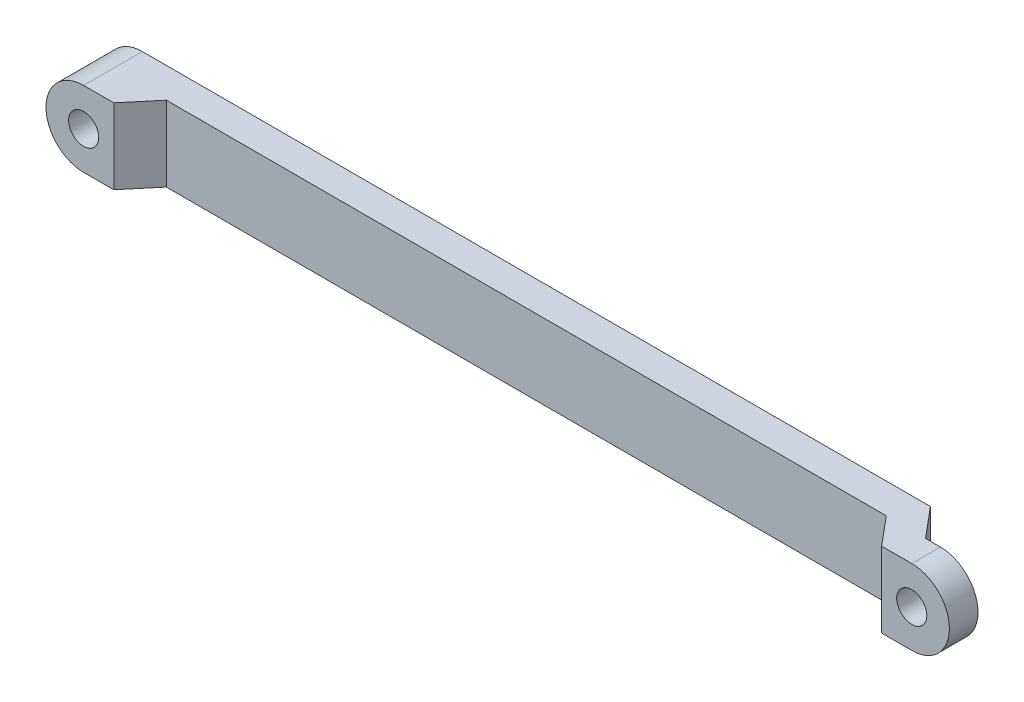
ISO-10303-21;
HEADER;
FILE_DESCRIPTION(('STEP AP214'),'2;1');
FILE_NAME('part.step','',(''),(''),'','','');
FILE_SCHEMA(('AUTOMOTIVE_DESIGN { 1 0 10303 214 1 1 1 1 }'));
ENDSEC;
DATA;
#1=APPLICATION_CONTEXT('core data for automotive mechanical design processes');
#2=APPLICATION_PROTOCOL_DEFINITION('international standard','automotive_design',2000,#1);
#3=PRODUCT_CONTEXT('',#1,'mechanical');
#4=PRODUCT('Part','Part','',(#3));
#5=PRODUCT_RELATED_PRODUCT_CATEGORY('part','',(#4));
#6=PRODUCT_DEFINITION_FORMATION('','',#4);
#7=PRODUCT_DEFINITION_CONTEXT('part definition',#1,'design');
#8=PRODUCT_DEFINITION('design','',#6,#7);
#9=PRODUCT_DEFINITION_SHAPE('','',#8);
#10=(LENGTH_UNIT() NAMED_UNIT(*) SI_UNIT(.MILLI.,.METRE.));
#11=(NAMED_UNIT(*) PLANE_ANGLE_UNIT() SI_UNIT($,.RADIAN.));
#12=(NAMED_UNIT(*) SI_UNIT($,.STERADIAN.) SOLID_ANGLE_UNIT());
#13=UNCERTAINTY_MEASURE_WITH_UNIT(LENGTH_MEASURE(1.E-05),#10,'distance_accuracy_value','');
#14=(GEOMETRIC_REPRESENTATION_CONTEXT(3) GLOBAL_UNCERTAINTY_ASSIGNED_CONTEXT((#13)) GLOBAL_UNIT_ASSIGNED_CONTEXT((#10,
#11,#12)) REPRESENTATION_CONTEXT('',''));
#15=CARTESIAN_POINT('',(0.,0.,0.));
#16=DIRECTION('',(0.,0.,1.));
#17=DIRECTION('',(1.,0.,0.));
#18=AXIS2_PLACEMENT_3D('',#15,#16,#17);
#19=CARTESIAN_POINT('',(-275.,0.,29.));
#20=DIRECTION('',(0.,0.,1.));
#21=DIRECTION('',(1.,0.,0.));
#22=AXIS2_PLACEMENT_3D('',#19,#20,#21);
#23=PLANE('',#22);
#24=DIRECTION('',(0.,-1.,0.));
#25=VECTOR('',#24,1.);
#26=CARTESIAN_POINT('',(255.,25.,29.0000000000017));
#27=LINE('',#26,#25);
#28=CARTESIAN_POINT('',(255.,25.,29.0000000000017));
#29=VERTEX_POINT('',#28);
#30=CARTESIAN_POINT('',(255.,-25.,29.0000000000017));
#31=VERTEX_POINT('',#30);
#32=EDGE_CURVE('E331',#29,#31,#27,.T.);
#33=ORIENTED_EDGE('',*,*,#32,.T.);
#34=DIRECTION('',(1.,0.,0.));
#35=VECTOR('',#34,1.);
#36=CARTESIAN_POINT('',(-275.,-25.,29.));
#37=LINE('',#36,#35);
#38=CARTESIAN_POINT('',(275.,-25.,29.));
#39=VERTEX_POINT('',#38);
#40=EDGE_CURVE('E130',#31,#39,#37,.T.);
#41=ORIENTED_EDGE('',*,*,#40,.T.);
#42=CARTESIAN_POINT('',(275.,0.,29.));
#43=DIRECTION('',(0.,0.,1.));
#44=DIRECTION('',(1.,0.,0.));
#45=AXIS2_PLACEMENT_3D('',#42,#43,#44);
#46=CIRCLE('',#45,25.);
#47=CARTESIAN_POINT('',(275.,25.,29.));
#48=VERTEX_POINT('',#47);
#49=EDGE_CURVE('E170',#39,#48,#46,.T.);
#50=ORIENTED_EDGE('',*,*,#49,.T.);
#51=DIRECTION('',(-1.,0.,0.));
#52=VECTOR('',#51,1.);
#53=CARTESIAN_POINT('',(-275.,25.,29.));
#54=LINE('',#53,#52);
#55=EDGE_CURVE('E138',#48,#29,#54,.T.);
#56=ORIENTED_EDGE('',*,*,#55,.T.);
#57=EDGE_LOOP('',(#33,#41,#50,#56));
#58=FACE_BOUND('',#57,.T.);
#59=CARTESIAN_POINT('',(275.,0.,29.));
#60=DIRECTION('',(0.,0.,1.));
#61=DIRECTION('',(1.,0.,0.));
#62=AXIS2_PLACEMENT_3D('',#59,#60,#61);
#63=CIRCLE('',#62,9.99999999999998);
#64=CARTESIAN_POINT('',(285.,0.,29.));
#65=VERTEX_POINT('',#64);
#66=EDGE_CURVE('E158',#65,#65,#63,.T.);
#67=ORIENTED_EDGE('',*,*,#66,.F.);
#68=EDGE_LOOP('',(#67));
#69=FACE_BOUND('',#68,.T.);
#70=ADVANCED_FACE('F16',(#58,#69),#23,.T.);
#71=DIRECTION('',(0.,-1.,0.));
#72=VECTOR('',#71,1.);
#73=CARTESIAN_POINT('',(-255.,25.,29.));
#74=LINE('',#73,#72);
#75=CARTESIAN_POINT('',(-255.,25.,29.));
#76=VERTEX_POINT('',#75);
#77=CARTESIAN_POINT('',(-255.,-25.,29.));
#78=VERTEX_POINT('',#77);
#79=EDGE_CURVE('E184',#76,#78,#74,.T.);
#80=ORIENTED_EDGE('',*,*,#79,.F.);
#81=CARTESIAN_POINT('',(-275.,25.,29.));
#82=VERTEX_POINT('',#81);
#83=EDGE_CURVE('E172',#76,#82,#54,.T.);
#84=ORIENTED_EDGE('',*,*,#83,.T.);
#85=CARTESIAN_POINT('',(-275.,0.,29.));
#86=DIRECTION('',(0.,0.,1.));
#87=DIRECTION('',(1.,0.,0.));
#88=AXIS2_PLACEMENT_3D('',#85,#86,#87);
#89=CIRCLE('',#88,25.);
#90=CARTESIAN_POINT('',(-275.,-25.,29.));
#91=VERTEX_POINT('',#90);
#92=EDGE_CURVE('E126',#82,#91,#89,.T.);
#93=ORIENTED_EDGE('',*,*,#92,.T.);
#94=EDGE_CURVE('E167',#91,#78,#37,.T.);
#95=ORIENTED_EDGE('',*,*,#94,.T.);
#96=EDGE_LOOP('',(#80,#84,#93,#95));
#97=FACE_BOUND('',#96,.T.);
#98=CARTESIAN_POINT('',(-275.,0.,29.));
#99=DIRECTION('',(0.,0.,1.));
#100=DIRECTION('',(1.,0.,0.));
#101=AXIS2_PLACEMENT_3D('',#98,#99,#100);
#102=CIRCLE('',#101,9.99999999999998);
#103=CARTESIAN_POINT('',(-265.,0.,29.));
#104=VERTEX_POINT('',#103);
#105=EDGE_CURVE('E160',#104,#104,#102,.T.);
#106=ORIENTED_EDGE('',*,*,#105,.F.);
#107=EDGE_LOOP('',(#106));
#108=FACE_BOUND('',#107,.T.);
#109=ADVANCED_FACE('F180',(#97,#108),#23,.T.);
#110=CARTESIAN_POINT('',(-275.,0.,-10.));
#111=DIRECTION('',(0.,0.,1.));
#112=DIRECTION('',(1.,0.,0.));
#113=AXIS2_PLACEMENT_3D('',#110,#111,#112);
#114=PLANE('',#113);
#115=DIRECTION('',(-1.,0.,0.));
#116=VECTOR('',#115,1.);
#117=CARTESIAN_POINT('',(-275.,25.,-10.));
#118=LINE('',#117,#116);
#119=CARTESIAN_POINT('',(248.38326017071,25.,-10.0000000000259));
#120=VERTEX_POINT('',#119);
#121=CARTESIAN_POINT('',(-275.,25.,-10.));
#122=VERTEX_POINT('',#121);
#123=EDGE_CURVE('E114',#120,#122,#118,.T.);
#124=ORIENTED_EDGE('',*,*,#123,.F.);
#125=DIRECTION('',(0.,-1.,0.));
#126=VECTOR('',#125,1.);
#127=CARTESIAN_POINT('',(248.38326017071,25.,-10.0000000000259));
#128=LINE('',#127,#126);
#129=CARTESIAN_POINT('',(248.38326017071,-25.,-10.0000000000259));
#130=VERTEX_POINT('',#129);
#131=EDGE_CURVE('E99',#120,#130,#128,.T.);
#132=ORIENTED_EDGE('',*,*,#131,.T.);
#133=DIRECTION('',(1.,0.,0.));
#134=VECTOR('',#133,1.);
#135=CARTESIAN_POINT('',(-275.,-25.,-10.));
#136=LINE('',#135,#134);
#137=CARTESIAN_POINT('',(-275.,-25.,-10.));
#138=VERTEX_POINT('',#137);
#139=EDGE_CURVE('E127',#138,#130,#136,.T.);
#140=ORIENTED_EDGE('',*,*,#139,.F.);
#141=CARTESIAN_POINT('',(-275.,0.,-10.));
#142=DIRECTION('',(0.,0.,1.));
#143=DIRECTION('',(1.,0.,0.));
#144=AXIS2_PLACEMENT_3D('',#141,#142,#143);
#145=CIRCLE('',#144,25.);
#146=EDGE_CURVE('E125',#122,#138,#145,.T.);
#147=ORIENTED_EDGE('',*,*,#146,.F.);
#148=EDGE_LOOP('',(#124,#132,#140,#147));
#149=FACE_BOUND('',#148,.T.);
#150=CARTESIAN_POINT('',(-275.,0.,-10.));
#151=DIRECTION('',(0.,0.,1.));
#152=DIRECTION('',(1.,0.,0.));
#153=AXIS2_PLACEMENT_3D('',#150,#151,#152);
#154=CIRCLE('',#153,9.99999999999998);
#155=CARTESIAN_POINT('',(-265.,0.,-10.));
#156=VERTEX_POINT('',#155);
#157=EDGE_CURVE('E163',#156,#156,#154,.T.);
#158=ORIENTED_EDGE('',*,*,#157,.T.);
#159=EDGE_LOOP('',(#158));
#160=FACE_BOUND('',#159,.T.);
#161=ADVANCED_FACE('F122',(#149,#160),#114,.F.);
#162=CARTESIAN_POINT('',(-275.,0.,29.));
#163=DIRECTION('',(0.,0.,-1.));
#164=DIRECTION('',(-1.,0.,0.));
#165=AXIS2_PLACEMENT_3D('',#162,#163,#164);
#166=CYLINDRICAL_SURFACE('',#165,25.);
#167=ORIENTED_EDGE('',*,*,#146,.T.);
#168=DIRECTION('',(0.,0.,-1.));
#169=VECTOR('',#168,1.);
#170=CARTESIAN_POINT('',(-275.,-25.,29.));
#171=LINE('',#170,#169);
#172=EDGE_CURVE('E143',#91,#138,#171,.T.);
#173=ORIENTED_EDGE('',*,*,#172,.F.);
#174=ORIENTED_EDGE('',*,*,#92,.F.);
#175=DIRECTION('',(0.,0.,-1.));
#176=VECTOR('',#175,1.);
#177=CARTESIAN_POINT('',(-275.,25.,29.));
#178=LINE('',#177,#176);
#179=EDGE_CURVE('E135',#82,#122,#178,.T.);
#180=ORIENTED_EDGE('',*,*,#179,.T.);
#181=EDGE_LOOP('',(#167,#173,#174,#180));
#182=FACE_BOUND('',#181,.T.);
#183=ADVANCED_FACE('F18',(#182),#166,.T.);
#184=CARTESIAN_POINT('',(-275.,-25.,29.));
#185=DIRECTION('',(0.,1.,0.));
#186=DIRECTION('',(0.,0.,1.));
#187=AXIS2_PLACEMENT_3D('',#184,#185,#186);
#188=PLANE('',#187);
#189=ORIENTED_EDGE('',*,*,#139,.T.);
#190=DIRECTION('',(0.642787609686536,0.,0.76604444311898));
#191=VECTOR('',#190,1.);
#192=CARTESIAN_POINT('',(51.3376559441181,-25.,-244.829806741966));
#193=LINE('',#192,#191);
#194=CARTESIAN_POINT('',(265.165252794277,-25.,9.99999999999997));
#195=VERTEX_POINT('',#194);
#196=EDGE_CURVE('E103',#130,#195,#193,.T.);
#197=ORIENTED_EDGE('',*,*,#196,.T.);
#198=DIRECTION('',(1.,0.,0.));
#199=VECTOR('',#198,1.);
#200=CARTESIAN_POINT('',(-275.,-25.,9.999999999999));
#201=LINE('',#200,#199);
#202=CARTESIAN_POINT('',(275.,-25.,9.99999999999999));
#203=VERTEX_POINT('',#202);
#204=EDGE_CURVE('E198',#195,#203,#201,.T.);
#205=ORIENTED_EDGE('',*,*,#204,.T.);
#206=DIRECTION('',(0.,0.,-1.));
#207=VECTOR('',#206,1.);
#208=CARTESIAN_POINT('',(275.,-25.,29.));
#209=LINE('',#208,#207);
#210=EDGE_CURVE('E140',#39,#203,#209,.T.);
#211=ORIENTED_EDGE('',*,*,#210,.F.);
#212=ORIENTED_EDGE('',*,*,#40,.F.);
#213=DIRECTION('',(-0.642787609686494,0.,-0.766044443119016));
#214=VECTOR('',#213,1.);
#215=CARTESIAN_POINT('',(36.0167670817664,-25.,-231.974054548229));
#216=LINE('',#215,#214);
#217=CARTESIAN_POINT('',(239.057107007632,-25.,10.));
#218=VERTEX_POINT('',#217);
#219=EDGE_CURVE('E196',#31,#218,#216,.T.);
#220=ORIENTED_EDGE('',*,*,#219,.T.);
#221=DIRECTION('',(-1.,0.,0.));
#222=VECTOR('',#221,1.);
#223=CARTESIAN_POINT('',(-275.,-25.,10.));
#224=LINE('',#223,#222);
#225=CARTESIAN_POINT('',(-239.057107007632,-25.,10.));
#226=VERTEX_POINT('',#225);
#227=EDGE_CURVE('E193',#218,#226,#224,.T.);
#228=ORIENTED_EDGE('',*,*,#227,.T.);
#229=DIRECTION('',(-0.642787609686536,0.,0.766044443118981));
#230=VECTOR('',#229,1.);
#231=CARTESIAN_POINT('',(-263.263518223331,-25.,38.8480775301221));
#232=LINE('',#231,#230);
#233=EDGE_CURVE('E191',#226,#78,#232,.T.);
#234=ORIENTED_EDGE('',*,*,#233,.T.);
#235=ORIENTED_EDGE('',*,*,#94,.F.);
#236=ORIENTED_EDGE('',*,*,#172,.T.);
#237=EDGE_LOOP('',(#189,#197,#205,#211,#212,#220,#228,#234,#235,#236));
#238=FACE_BOUND('',#237,.T.);
#239=ADVANCED_FACE('F188',(#238),#188,.F.);
#240=CARTESIAN_POINT('',(275.,0.,29.));
#241=DIRECTION('',(0.,0.,-1.));
#242=DIRECTION('',(-1.,0.,0.));
#243=AXIS2_PLACEMENT_3D('',#240,#241,#242);
#244=CYLINDRICAL_SURFACE('',#243,25.);
#245=CARTESIAN_POINT('',(275.,0.,9.99999999999999));
#246=DIRECTION('',(0.,0.,1.));
#247=DIRECTION('',(1.,0.,0.));
#248=AXIS2_PLACEMENT_3D('',#245,#246,#247);
#249=CIRCLE('',#248,25.);
#250=CARTESIAN_POINT('',(275.,25.,9.99999999999999));
#251=VERTEX_POINT('',#250);
#252=EDGE_CURVE('E336',#203,#251,#249,.T.);
#253=ORIENTED_EDGE('',*,*,#252,.T.);
#254=DIRECTION('',(0.,0.,-1.));
#255=VECTOR('',#254,1.);
#256=CARTESIAN_POINT('',(275.,25.,29.));
#257=LINE('',#256,#255);
#258=EDGE_CURVE('E137',#48,#251,#257,.T.);
#259=ORIENTED_EDGE('',*,*,#258,.F.);
#260=ORIENTED_EDGE('',*,*,#49,.F.);
#261=ORIENTED_EDGE('',*,*,#210,.T.);
#262=EDGE_LOOP('',(#253,#259,#260,#261));
#263=FACE_BOUND('',#262,.T.);
#264=ADVANCED_FACE('F225',(#263),#244,.T.);
#265=CARTESIAN_POINT('',(-275.,25.,29.));
#266=DIRECTION('',(0.,-1.,0.));
#267=DIRECTION('',(0.,0.,-1.));
#268=AXIS2_PLACEMENT_3D('',#265,#266,#267);
#269=PLANE('',#268);
#270=DIRECTION('',(-1.,0.,0.));
#271=VECTOR('',#270,1.);
#272=CARTESIAN_POINT('',(265.165252794277,25.,9.99999999999997));
#273=LINE('',#272,#271);
#274=CARTESIAN_POINT('',(265.165252794277,25.,9.99999999999997));
#275=VERTEX_POINT('',#274);
#276=EDGE_CURVE('E118',#251,#275,#273,.T.);
#277=ORIENTED_EDGE('',*,*,#276,.T.);
#278=DIRECTION('',(-0.642787609686536,0.,-0.76604444311898));
#279=VECTOR('',#278,1.);
#280=CARTESIAN_POINT('',(265.165252794277,25.,9.99999999999997));
#281=LINE('',#280,#279);
#282=EDGE_CURVE('E31',#275,#120,#281,.T.);
#283=ORIENTED_EDGE('',*,*,#282,.T.);
#284=ORIENTED_EDGE('',*,*,#123,.T.);
#285=ORIENTED_EDGE('',*,*,#179,.F.);
#286=ORIENTED_EDGE('',*,*,#83,.F.);
#287=DIRECTION('',(0.642787609686536,0.,-0.766044443118981));
#288=VECTOR('',#287,1.);
#289=CARTESIAN_POINT('',(-239.057107007632,25.,10.));
#290=LINE('',#289,#288);
#291=CARTESIAN_POINT('',(-239.057107007632,25.,10.));
#292=VERTEX_POINT('',#291);
#293=EDGE_CURVE('E326',#76,#292,#290,.T.);
#294=ORIENTED_EDGE('',*,*,#293,.T.);
#295=DIRECTION('',(1.,0.,0.));
#296=VECTOR('',#295,1.);
#297=CARTESIAN_POINT('',(239.057107007632,25.,10.));
#298=LINE('',#297,#296);
#299=CARTESIAN_POINT('',(239.057107007632,25.,10.));
#300=VERTEX_POINT('',#299);
#301=EDGE_CURVE('E39',#292,#300,#298,.T.);
#302=ORIENTED_EDGE('',*,*,#301,.T.);
#303=DIRECTION('',(0.642787609686494,0.,0.766044443119016));
#304=VECTOR('',#303,1.);
#305=CARTESIAN_POINT('',(239.057107007632,25.,10.));
#306=LINE('',#305,#304);
#307=EDGE_CURVE('E107',#300,#29,#306,.T.);
#308=ORIENTED_EDGE('',*,*,#307,.T.);
#309=ORIENTED_EDGE('',*,*,#55,.F.);
#310=ORIENTED_EDGE('',*,*,#258,.T.);
#311=EDGE_LOOP('',(#277,#283,#284,#285,#286,#294,#302,#308,#309,#310));
#312=FACE_BOUND('',#311,.T.);
#313=ADVANCED_FACE('F112',(#312),#269,.F.);
#314=CARTESIAN_POINT('',(275.,0.,29.));
#315=DIRECTION('',(0.,0.,-1.));
#316=DIRECTION('',(-1.,0.,0.));
#317=AXIS2_PLACEMENT_3D('',#314,#315,#316);
#318=CYLINDRICAL_SURFACE('',#317,9.99999999999998);
#319=CARTESIAN_POINT('',(275.,0.,21.7205953146759));
#320=DIRECTION('',(-0.76604444311898,0.,0.642787609686536));
#321=DIRECTION('',(-0.642787609686536,0.,-0.76604444311898));
#322=AXIS2_PLACEMENT_3D('',#319,#320,#321);
#323=ELLIPSE('',#322,15.5572382686042,9.99999999999998);
#324=CARTESIAN_POINT('',(265.165252794277,1.81045502554755,9.99999999999997));
#325=VERTEX_POINT('',#324);
#326=CARTESIAN_POINT('',(265.165252794277,-1.81045502554755,9.99999999999997));
#327=VERTEX_POINT('',#326);
#328=EDGE_CURVE('E10',#325,#327,#323,.T.);
#329=ORIENTED_EDGE('',*,*,#328,.F.);
#330=CARTESIAN_POINT('',(275.,0.,9.99999999999999));
#331=DIRECTION('',(0.,0.,1.));
#332=DIRECTION('',(1.,0.,0.));
#333=AXIS2_PLACEMENT_3D('',#330,#331,#332);
#334=CIRCLE('',#333,9.99999999999998);
#335=EDGE_CURVE('E24',#327,#325,#334,.T.);
#336=ORIENTED_EDGE('',*,*,#335,.F.);
#337=EDGE_LOOP('',(#329,#336));
#338=FACE_BOUND('',#337,.T.);
#339=ORIENTED_EDGE('',*,*,#66,.T.);
#340=EDGE_LOOP('',(#339));
#341=FACE_BOUND('',#340,.T.);
#342=ADVANCED_FACE('F151',(#338,#341),#318,.F.);
#343=CARTESIAN_POINT('',(-275.,0.,29.));
#344=DIRECTION('',(0.,0.,-1.));
#345=DIRECTION('',(-1.,0.,0.));
#346=AXIS2_PLACEMENT_3D('',#343,#344,#345);
#347=CYLINDRICAL_SURFACE('',#346,9.99999999999998);
#348=ORIENTED_EDGE('',*,*,#105,.T.);
#349=EDGE_LOOP('',(#348));
#350=FACE_BOUND('',#349,.T.);
#351=ORIENTED_EDGE('',*,*,#157,.F.);
#352=EDGE_LOOP('',(#351));
#353=FACE_BOUND('',#352,.T.);
#354=ADVANCED_FACE('F154',(#350,#353),#347,.F.);
#355=CARTESIAN_POINT('',(265.165252794277,25.,9.99999999999997));
#356=DIRECTION('',(-0.76604444311898,0.,0.642787609686536));
#357=DIRECTION('',(0.642787609686536,0.,0.76604444311898));
#358=AXIS2_PLACEMENT_3D('',#355,#356,#357);
#359=PLANE('',#358);
#360=ORIENTED_EDGE('',*,*,#131,.F.);
#361=ORIENTED_EDGE('',*,*,#282,.F.);
#362=DIRECTION('',(0.,-1.,0.));
#363=VECTOR('',#362,1.);
#364=CARTESIAN_POINT('',(265.165252794277,25.,9.99999999999997));
#365=LINE('',#364,#363);
#366=EDGE_CURVE('E108',#275,#325,#365,.T.);
#367=ORIENTED_EDGE('',*,*,#366,.T.);
#368=ORIENTED_EDGE('',*,*,#328,.T.);
#369=EDGE_CURVE('E119',#327,#195,#365,.T.);
#370=ORIENTED_EDGE('',*,*,#369,.T.);
#371=ORIENTED_EDGE('',*,*,#196,.F.);
#372=EDGE_LOOP('',(#360,#361,#367,#368,#370,#371));
#373=FACE_BOUND('',#372,.T.);
#374=ADVANCED_FACE('F100',(#373),#359,.F.);
#375=CARTESIAN_POINT('',(265.165252794277,25.,9.99999999999997));
#376=DIRECTION('',(0.,0.,1.));
#377=DIRECTION('',(1.,0.,0.));
#378=AXIS2_PLACEMENT_3D('',#375,#376,#377);
#379=PLANE('',#378);
#380=ORIENTED_EDGE('',*,*,#369,.F.);
#381=ORIENTED_EDGE('',*,*,#335,.T.);
#382=ORIENTED_EDGE('',*,*,#366,.F.);
#383=ORIENTED_EDGE('',*,*,#276,.F.);
#384=ORIENTED_EDGE('',*,*,#252,.F.);
#385=ORIENTED_EDGE('',*,*,#204,.F.);
#386=EDGE_LOOP('',(#380,#381,#382,#383,#384,#385));
#387=FACE_BOUND('',#386,.T.);
#388=ADVANCED_FACE('F147',(#387),#379,.F.);
#389=CARTESIAN_POINT('',(239.057107007632,25.,10.));
#390=DIRECTION('',(0.766044443119016,0.,-0.642787609686494));
#391=DIRECTION('',(-0.642787609686494,0.,-0.766044443119016));
#392=AXIS2_PLACEMENT_3D('',#389,#390,#391);
#393=PLANE('',#392);
#394=ORIENTED_EDGE('',*,*,#32,.F.);
#395=ORIENTED_EDGE('',*,*,#307,.F.);
#396=DIRECTION('',(0.,-1.,0.));
#397=VECTOR('',#396,1.);
#398=CARTESIAN_POINT('',(239.057107007632,25.,10.));
#399=LINE('',#398,#397);
#400=EDGE_CURVE('E327',#300,#218,#399,.T.);
#401=ORIENTED_EDGE('',*,*,#400,.T.);
#402=ORIENTED_EDGE('',*,*,#219,.F.);
#403=EDGE_LOOP('',(#394,#395,#401,#402));
#404=FACE_BOUND('',#403,.T.);
#405=ADVANCED_FACE('F295',(#404),#393,.F.);
#406=CARTESIAN_POINT('',(239.057107007632,25.,10.));
#407=DIRECTION('',(0.,0.,-1.));
#408=DIRECTION('',(-1.,0.,0.));
#409=AXIS2_PLACEMENT_3D('',#406,#407,#408);
#410=PLANE('',#409);
#411=ORIENTED_EDGE('',*,*,#400,.F.);
#412=ORIENTED_EDGE('',*,*,#301,.F.);
#413=DIRECTION('',(0.,-1.,0.));
#414=VECTOR('',#413,1.);
#415=CARTESIAN_POINT('',(-239.057107007632,25.,10.));
#416=LINE('',#415,#414);
#417=EDGE_CURVE('E325',#292,#226,#416,.T.);
#418=ORIENTED_EDGE('',*,*,#417,.T.);
#419=ORIENTED_EDGE('',*,*,#227,.F.);
#420=EDGE_LOOP('',(#411,#412,#418,#419));
#421=FACE_BOUND('',#420,.T.);
#422=ADVANCED_FACE('F303',(#421),#410,.F.);
#423=CARTESIAN_POINT('',(-239.057107007632,25.,10.));
#424=DIRECTION('',(-0.766044443118981,0.,-0.642787609686536));
#425=DIRECTION('',(-0.642787609686536,0.,0.766044443118981));
#426=AXIS2_PLACEMENT_3D('',#423,#424,#425);
#427=PLANE('',#426);
#428=ORIENTED_EDGE('',*,*,#417,.F.);
#429=ORIENTED_EDGE('',*,*,#293,.F.);
#430=ORIENTED_EDGE('',*,*,#79,.T.);
#431=ORIENTED_EDGE('',*,*,#233,.F.);
#432=EDGE_LOOP('',(#428,#429,#430,#431));
#433=FACE_BOUND('',#432,.T.);
#434=ADVANCED_FACE('F311',(#433),#427,.F.);
#435=CLOSED_SHELL('',(#70,#109,#161,#183,#239,#264,#313,#342,#354,#374,#388,#405,#422,#434));
#436=MANIFOLD_SOLID_BREP('B1',#435);
#437=ADVANCED_BREP_SHAPE_REPRESENTATION('',(#18,#436),#14);
#438=SHAPE_DEFINITION_REPRESENTATION(#9,#437);
ENDSEC;
END-ISO-10303-21;
